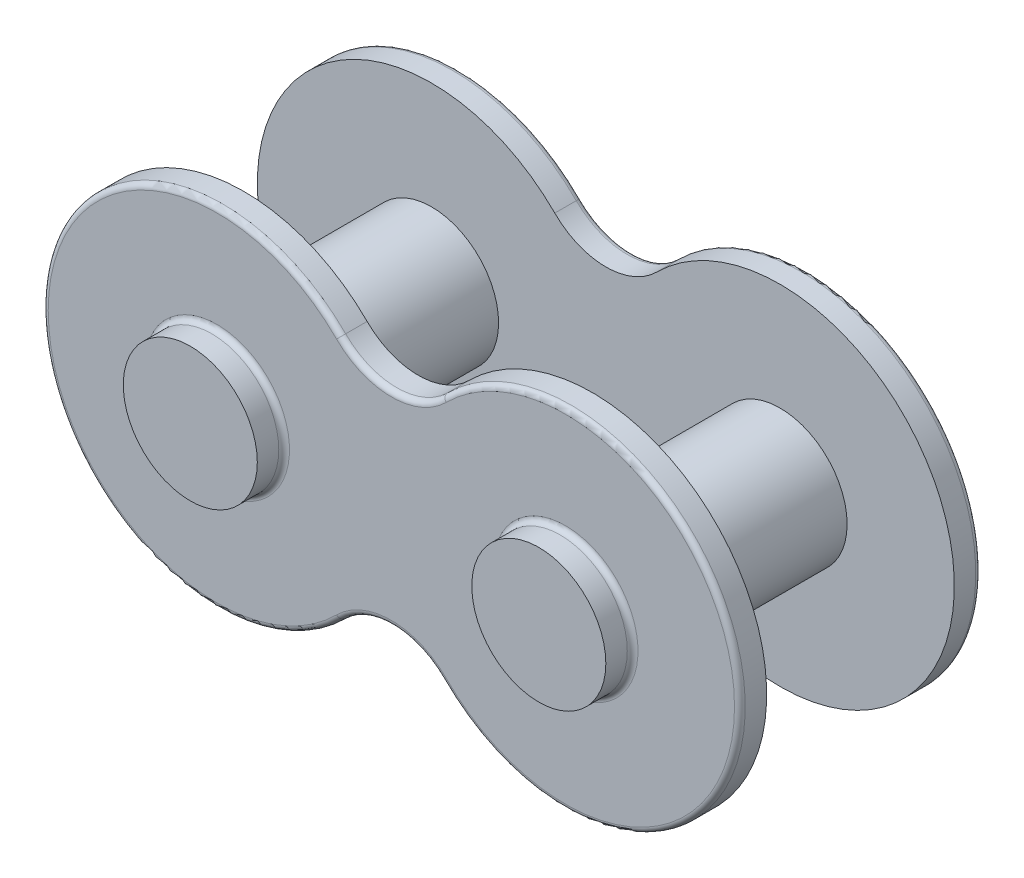
ISO-10303-21;
HEADER;
FILE_DESCRIPTION(('STEP AP214'),'2;1');
FILE_NAME('part.step','',(''),(''),'','','');
FILE_SCHEMA(('AUTOMOTIVE_DESIGN { 1 0 10303 214 1 1 1 1 }'));
ENDSEC;
DATA;
#1=APPLICATION_CONTEXT('core data for automotive mechanical design processes');
#2=APPLICATION_PROTOCOL_DEFINITION('international standard','automotive_design',2000,#1);
#3=PRODUCT_CONTEXT('',#1,'mechanical');
#4=PRODUCT('Part','Part','',(#3));
#5=PRODUCT_RELATED_PRODUCT_CATEGORY('part','',(#4));
#6=PRODUCT_DEFINITION_FORMATION('','',#4);
#7=PRODUCT_DEFINITION_CONTEXT('part definition',#1,'design');
#8=PRODUCT_DEFINITION('design','',#6,#7);
#9=PRODUCT_DEFINITION_SHAPE('','',#8);
#10=(LENGTH_UNIT() NAMED_UNIT(*) SI_UNIT(.MILLI.,.METRE.));
#11=(NAMED_UNIT(*) PLANE_ANGLE_UNIT() SI_UNIT($,.RADIAN.));
#12=(NAMED_UNIT(*) SI_UNIT($,.STERADIAN.) SOLID_ANGLE_UNIT());
#13=UNCERTAINTY_MEASURE_WITH_UNIT(LENGTH_MEASURE(1.E-05),#10,'distance_accuracy_value','');
#14=(GEOMETRIC_REPRESENTATION_CONTEXT(3) GLOBAL_UNCERTAINTY_ASSIGNED_CONTEXT((#13)) GLOBAL_UNIT_ASSIGNED_CONTEXT((#10,
#11,#12)) REPRESENTATION_CONTEXT('',''));
#15=CARTESIAN_POINT('',(0.,0.,0.));
#16=DIRECTION('',(0.,0.,1.));
#17=DIRECTION('',(1.,0.,0.));
#18=AXIS2_PLACEMENT_3D('',#15,#16,#17);
#19=CARTESIAN_POINT('',(-3.25,-3.25,1.));
#20=DIRECTION('',(0.,0.,1.));
#21=DIRECTION('',(1.,0.,0.));
#22=AXIS2_PLACEMENT_3D('',#19,#20,#21);
#23=PLANE('',#22);
#24=CARTESIAN_POINT('',(-6.5,0.,1.));
#25=DIRECTION('',(0.,0.,1.));
#26=DIRECTION('',(1.,0.,0.));
#27=AXIS2_PLACEMENT_3D('',#24,#25,#26);
#28=CIRCLE('',#27,2.5);
#29=CARTESIAN_POINT('',(-4.,0.,1.));
#30=VERTEX_POINT('',#29);
#31=EDGE_CURVE('E174',#30,#30,#28,.T.);
#32=ORIENTED_EDGE('',*,*,#31,.F.);
#33=EDGE_LOOP('',(#32));
#34=FACE_BOUND('',#33,.T.);
#35=CARTESIAN_POINT('',(0.,-6.5,1.));
#36=DIRECTION('',(0.,0.,-1.));
#37=DIRECTION('',(1.,0.,0.));
#38=AXIS2_PLACEMENT_3D('',#35,#36,#37);
#39=CIRCLE('',#38,2.69238815542512);
#40=CARTESIAN_POINT('',(-1.90380592228744,-4.59619407771256,1.));
#41=VERTEX_POINT('',#40);
#42=CARTESIAN_POINT('',(1.90380592228744,-4.59619407771256,1.));
#43=VERTEX_POINT('',#42);
#44=EDGE_CURVE('E177',#41,#43,#39,.T.);
#45=ORIENTED_EDGE('',*,*,#44,.T.);
#46=CARTESIAN_POINT('',(6.5,0.,1.));
#47=DIRECTION('',(0.,0.,1.));
#48=DIRECTION('',(1.,0.,0.));
#49=AXIS2_PLACEMENT_3D('',#46,#47,#48);
#50=CIRCLE('',#49,6.5);
#51=CARTESIAN_POINT('',(1.90380592228744,4.59619407771256,1.));
#52=VERTEX_POINT('',#51);
#53=EDGE_CURVE('E180',#43,#52,#50,.T.);
#54=ORIENTED_EDGE('',*,*,#53,.T.);
#55=CARTESIAN_POINT('',(0.,6.5,1.));
#56=DIRECTION('',(0.,0.,-1.));
#57=DIRECTION('',(1.,0.,0.));
#58=AXIS2_PLACEMENT_3D('',#55,#56,#57);
#59=CIRCLE('',#58,2.69238815542512);
#60=CARTESIAN_POINT('',(-1.90380592228744,4.59619407771256,1.));
#61=VERTEX_POINT('',#60);
#62=EDGE_CURVE('E182',#52,#61,#59,.T.);
#63=ORIENTED_EDGE('',*,*,#62,.T.);
#64=CARTESIAN_POINT('',(-6.5,0.,1.));
#65=DIRECTION('',(0.,0.,1.));
#66=DIRECTION('',(1.,0.,0.));
#67=AXIS2_PLACEMENT_3D('',#64,#65,#66);
#68=CIRCLE('',#67,6.5);
#69=EDGE_CURVE('E184',#61,#41,#68,.T.);
#70=ORIENTED_EDGE('',*,*,#69,.T.);
#71=EDGE_LOOP('',(#45,#54,#63,#70));
#72=FACE_BOUND('',#71,.T.);
#73=CARTESIAN_POINT('',(6.5,0.,1.));
#74=DIRECTION('',(0.,0.,1.));
#75=DIRECTION('',(1.,0.,0.));
#76=AXIS2_PLACEMENT_3D('',#73,#74,#75);
#77=CIRCLE('',#76,2.5);
#78=CARTESIAN_POINT('',(9.,0.,1.));
#79=VERTEX_POINT('',#78);
#80=EDGE_CURVE('E171',#79,#79,#77,.T.);
#81=ORIENTED_EDGE('',*,*,#80,.F.);
#82=EDGE_LOOP('',(#81));
#83=FACE_BOUND('',#82,.T.);
#84=ADVANCED_FACE('F33',(#34,#72,#83),#23,.T.);
#85=CARTESIAN_POINT('',(-3.25,-3.25,0.));
#86=DIRECTION('',(0.,0.,1.));
#87=DIRECTION('',(1.,0.,0.));
#88=AXIS2_PLACEMENT_3D('',#85,#86,#87);
#89=PLANE('',#88);
#90=CARTESIAN_POINT('',(6.5,0.,0.));
#91=DIRECTION('',(0.,0.,1.));
#92=DIRECTION('',(1.,0.,0.));
#93=AXIS2_PLACEMENT_3D('',#90,#91,#92);
#94=CIRCLE('',#93,2.7);
#95=CARTESIAN_POINT('',(9.2,0.,0.));
#96=VERTEX_POINT('',#95);
#97=EDGE_CURVE('E216',#96,#96,#94,.T.);
#98=ORIENTED_EDGE('',*,*,#97,.T.);
#99=EDGE_LOOP('',(#98));
#100=FACE_BOUND('',#99,.T.);
#101=CARTESIAN_POINT('',(-6.5,0.,0.));
#102=DIRECTION('',(0.,0.,1.));
#103=DIRECTION('',(1.,0.,0.));
#104=AXIS2_PLACEMENT_3D('',#101,#102,#103);
#105=CIRCLE('',#104,2.7);
#106=CARTESIAN_POINT('',(-3.8,0.,0.));
#107=VERTEX_POINT('',#106);
#108=EDGE_CURVE('E213',#107,#107,#105,.T.);
#109=ORIENTED_EDGE('',*,*,#108,.T.);
#110=EDGE_LOOP('',(#109));
#111=FACE_BOUND('',#110,.T.);
#112=CARTESIAN_POINT('',(0.,6.5,0.));
#113=DIRECTION('',(0.,0.,1.));
#114=DIRECTION('',(1.,0.,0.));
#115=AXIS2_PLACEMENT_3D('',#112,#113,#114);
#116=CIRCLE('',#115,2.89238815542512);
#117=CARTESIAN_POINT('',(-2.04522727852475,4.45477272147525,0.));
#118=VERTEX_POINT('',#117);
#119=CARTESIAN_POINT('',(2.04522727852475,4.45477272147525,0.));
#120=VERTEX_POINT('',#119);
#121=EDGE_CURVE('E208',#118,#120,#116,.T.);
#122=ORIENTED_EDGE('',*,*,#121,.T.);
#123=CARTESIAN_POINT('',(6.5,0.,0.));
#124=DIRECTION('',(0.,0.,1.));
#125=DIRECTION('',(1.,0.,0.));
#126=AXIS2_PLACEMENT_3D('',#123,#124,#125);
#127=CIRCLE('',#126,6.3);
#128=CARTESIAN_POINT('',(2.04522727852475,-4.45477272147525,0.));
#129=VERTEX_POINT('',#128);
#130=EDGE_CURVE('E210',#120,#129,#127,.F.);
#131=ORIENTED_EDGE('',*,*,#130,.T.);
#132=CARTESIAN_POINT('',(0.,-6.5,0.));
#133=DIRECTION('',(0.,0.,1.));
#134=DIRECTION('',(1.,0.,0.));
#135=AXIS2_PLACEMENT_3D('',#132,#133,#134);
#136=CIRCLE('',#135,2.89238815542512);
#137=CARTESIAN_POINT('',(-2.04522727852475,-4.45477272147525,0.));
#138=VERTEX_POINT('',#137);
#139=EDGE_CURVE('E204',#129,#138,#136,.T.);
#140=ORIENTED_EDGE('',*,*,#139,.T.);
#141=CARTESIAN_POINT('',(-6.5,0.,0.));
#142=DIRECTION('',(0.,0.,1.));
#143=DIRECTION('',(1.,0.,0.));
#144=AXIS2_PLACEMENT_3D('',#141,#142,#143);
#145=CIRCLE('',#144,6.3);
#146=EDGE_CURVE('E206',#138,#118,#145,.F.);
#147=ORIENTED_EDGE('',*,*,#146,.T.);
#148=EDGE_LOOP('',(#122,#131,#140,#147));
#149=FACE_BOUND('',#148,.T.);
#150=ADVANCED_FACE('F301',(#100,#111,#149),#89,.F.);
#151=CARTESIAN_POINT('',(0.,-6.5,1.));
#152=DIRECTION('',(0.,0.,-1.));
#153=DIRECTION('',(-1.,0.,0.));
#154=AXIS2_PLACEMENT_3D('',#151,#152,#153);
#155=CYLINDRICAL_SURFACE('',#154,2.69238815542512);
#156=DIRECTION('',(0.,0.,-1.));
#157=VECTOR('',#156,1.);
#158=CARTESIAN_POINT('',(-1.90380592228744,-4.59619407771256,1.));
#159=LINE('',#158,#157);
#160=CARTESIAN_POINT('',(-1.90380592228744,-4.59619407771256,0.2));
#161=VERTEX_POINT('',#160);
#162=EDGE_CURVE('E186',#41,#161,#159,.T.);
#163=ORIENTED_EDGE('',*,*,#162,.T.);
#164=CARTESIAN_POINT('',(0.,-6.5,0.2));
#165=DIRECTION('',(0.,0.,1.));
#166=DIRECTION('',(1.,0.,0.));
#167=AXIS2_PLACEMENT_3D('',#164,#165,#166);
#168=CIRCLE('',#167,2.69238815542512);
#169=CARTESIAN_POINT('',(1.90380592228744,-4.59619407771256,0.2));
#170=VERTEX_POINT('',#169);
#171=EDGE_CURVE('E232',#161,#170,#168,.F.);
#172=ORIENTED_EDGE('',*,*,#171,.T.);
#173=DIRECTION('',(0.,0.,-1.));
#174=VECTOR('',#173,1.);
#175=CARTESIAN_POINT('',(1.90380592228744,-4.59619407771256,1.));
#176=LINE('',#175,#174);
#177=EDGE_CURVE('E195',#43,#170,#176,.T.);
#178=ORIENTED_EDGE('',*,*,#177,.F.);
#179=ORIENTED_EDGE('',*,*,#44,.F.);
#180=EDGE_LOOP('',(#163,#172,#178,#179));
#181=FACE_BOUND('',#180,.T.);
#182=ADVANCED_FACE('F307',(#181),#155,.F.);
#183=CARTESIAN_POINT('',(6.5,0.,1.));
#184=DIRECTION('',(0.,0.,-1.));
#185=DIRECTION('',(-1.,0.,0.));
#186=AXIS2_PLACEMENT_3D('',#183,#184,#185);
#187=CYLINDRICAL_SURFACE('',#186,6.5);
#188=ORIENTED_EDGE('',*,*,#177,.T.);
#189=CARTESIAN_POINT('',(6.5,0.,0.2));
#190=DIRECTION('',(0.,0.,1.));
#191=DIRECTION('',(1.,0.,0.));
#192=AXIS2_PLACEMENT_3D('',#189,#190,#191);
#193=CIRCLE('',#192,6.5);
#194=CARTESIAN_POINT('',(1.90380592228744,4.59619407771256,0.2));
#195=VERTEX_POINT('',#194);
#196=EDGE_CURVE('E225',#170,#195,#193,.T.);
#197=ORIENTED_EDGE('',*,*,#196,.T.);
#198=DIRECTION('',(0.,0.,-1.));
#199=VECTOR('',#198,1.);
#200=CARTESIAN_POINT('',(1.90380592228744,4.59619407771256,1.));
#201=LINE('',#200,#199);
#202=EDGE_CURVE('E192',#52,#195,#201,.T.);
#203=ORIENTED_EDGE('',*,*,#202,.F.);
#204=ORIENTED_EDGE('',*,*,#53,.F.);
#205=EDGE_LOOP('',(#188,#197,#203,#204));
#206=FACE_BOUND('',#205,.T.);
#207=ADVANCED_FACE('F324',(#206),#187,.T.);
#208=CARTESIAN_POINT('',(0.,6.5,1.));
#209=DIRECTION('',(0.,0.,-1.));
#210=DIRECTION('',(-1.,0.,0.));
#211=AXIS2_PLACEMENT_3D('',#208,#209,#210);
#212=CYLINDRICAL_SURFACE('',#211,2.69238815542512);
#213=ORIENTED_EDGE('',*,*,#202,.T.);
#214=CARTESIAN_POINT('',(0.,6.5,0.2));
#215=DIRECTION('',(0.,0.,1.));
#216=DIRECTION('',(1.,0.,0.));
#217=AXIS2_PLACEMENT_3D('',#214,#215,#216);
#218=CIRCLE('',#217,2.69238815542512);
#219=CARTESIAN_POINT('',(-1.90380592228744,4.59619407771256,0.2));
#220=VERTEX_POINT('',#219);
#221=EDGE_CURVE('E228',#195,#220,#218,.F.);
#222=ORIENTED_EDGE('',*,*,#221,.T.);
#223=DIRECTION('',(0.,0.,-1.));
#224=VECTOR('',#223,1.);
#225=CARTESIAN_POINT('',(-1.90380592228744,4.59619407771256,1.));
#226=LINE('',#225,#224);
#227=EDGE_CURVE('E189',#61,#220,#226,.T.);
#228=ORIENTED_EDGE('',*,*,#227,.F.);
#229=ORIENTED_EDGE('',*,*,#62,.F.);
#230=EDGE_LOOP('',(#213,#222,#228,#229));
#231=FACE_BOUND('',#230,.T.);
#232=ADVANCED_FACE('F320',(#231),#212,.F.);
#233=CARTESIAN_POINT('',(-6.5,0.,1.));
#234=DIRECTION('',(0.,0.,-1.));
#235=DIRECTION('',(-1.,0.,0.));
#236=AXIS2_PLACEMENT_3D('',#233,#234,#235);
#237=CYLINDRICAL_SURFACE('',#236,6.5);
#238=ORIENTED_EDGE('',*,*,#227,.T.);
#239=CARTESIAN_POINT('',(-6.5,0.,0.2));
#240=DIRECTION('',(0.,0.,1.));
#241=DIRECTION('',(1.,0.,0.));
#242=AXIS2_PLACEMENT_3D('',#239,#240,#241);
#243=CIRCLE('',#242,6.5);
#244=EDGE_CURVE('E230',#220,#161,#243,.T.);
#245=ORIENTED_EDGE('',*,*,#244,.T.);
#246=ORIENTED_EDGE('',*,*,#162,.F.);
#247=ORIENTED_EDGE('',*,*,#69,.F.);
#248=EDGE_LOOP('',(#238,#245,#246,#247));
#249=FACE_BOUND('',#248,.T.);
#250=ADVANCED_FACE('F316',(#249),#237,.T.);
#251=CARTESIAN_POINT('',(-6.5,0.,-1.));
#252=DIRECTION('',(0.,0.,1.));
#253=DIRECTION('',(1.,0.,0.));
#254=AXIS2_PLACEMENT_3D('',#251,#252,#253);
#255=PLANE('',#254);
#256=CARTESIAN_POINT('',(-6.5,0.,-1.));
#257=DIRECTION('',(0.,0.,1.));
#258=DIRECTION('',(1.,0.,0.));
#259=AXIS2_PLACEMENT_3D('',#256,#257,#258);
#260=CIRCLE('',#259,2.5);
#261=CARTESIAN_POINT('',(-4.,0.,-1.));
#262=VERTEX_POINT('',#261);
#263=EDGE_CURVE('E168',#262,#262,#260,.T.);
#264=ORIENTED_EDGE('',*,*,#263,.F.);
#265=EDGE_LOOP('',(#264));
#266=FACE_BOUND('',#265,.T.);
#267=ADVANCED_FACE('F319',(#266),#255,.F.);
#268=CARTESIAN_POINT('',(-6.5,0.,-1.));
#269=DIRECTION('',(0.,0.,1.));
#270=DIRECTION('',(1.,0.,0.));
#271=AXIS2_PLACEMENT_3D('',#268,#269,#270);
#272=CYLINDRICAL_SURFACE('',#271,2.5);
#273=CARTESIAN_POINT('',(-6.5,0.,-0.2));
#274=DIRECTION('',(0.,0.,1.));
#275=DIRECTION('',(1.,0.,0.));
#276=AXIS2_PLACEMENT_3D('',#273,#274,#275);
#277=CIRCLE('',#276,2.5);
#278=CARTESIAN_POINT('',(-4.,0.,-0.2));
#279=VERTEX_POINT('',#278);
#280=EDGE_CURVE('E222',#279,#279,#277,.F.);
#281=ORIENTED_EDGE('',*,*,#280,.T.);
#282=EDGE_LOOP('',(#281));
#283=FACE_BOUND('',#282,.T.);
#284=ORIENTED_EDGE('',*,*,#263,.T.);
#285=EDGE_LOOP('',(#284));
#286=FACE_BOUND('',#285,.T.);
#287=ADVANCED_FACE('F380',(#283,#286),#272,.T.);
#288=CARTESIAN_POINT('',(-6.5,0.,8.));
#289=DIRECTION('',(0.,0.,-1.));
#290=DIRECTION('',(-1.,0.,0.));
#291=AXIS2_PLACEMENT_3D('',#288,#289,#290);
#292=CIRCLE('',#291,2.5);
#293=CARTESIAN_POINT('',(-9.,0.,8.));
#294=VERTEX_POINT('',#293);
#295=EDGE_CURVE('E201',#294,#294,#292,.F.);
#296=ORIENTED_EDGE('',*,*,#295,.F.);
#297=EDGE_LOOP('',(#296));
#298=FACE_BOUND('',#297,.T.);
#299=ORIENTED_EDGE('',*,*,#31,.T.);
#300=EDGE_LOOP('',(#299));
#301=FACE_BOUND('',#300,.T.);
#302=ADVANCED_FACE('F313',(#298,#301),#272,.T.);
#303=CARTESIAN_POINT('',(6.5,0.,-1.));
#304=DIRECTION('',(0.,0.,1.));
#305=DIRECTION('',(1.,0.,0.));
#306=AXIS2_PLACEMENT_3D('',#303,#304,#305);
#307=PLANE('',#306);
#308=CARTESIAN_POINT('',(6.5,0.,-1.));
#309=DIRECTION('',(0.,0.,1.));
#310=DIRECTION('',(1.,0.,0.));
#311=AXIS2_PLACEMENT_3D('',#308,#309,#310);
#312=CIRCLE('',#311,2.5);
#313=CARTESIAN_POINT('',(9.,0.,-1.));
#314=VERTEX_POINT('',#313);
#315=EDGE_CURVE('E162',#314,#314,#312,.T.);
#316=ORIENTED_EDGE('',*,*,#315,.F.);
#317=EDGE_LOOP('',(#316));
#318=FACE_BOUND('',#317,.T.);
#319=ADVANCED_FACE('F403',(#318),#307,.F.);
#320=CARTESIAN_POINT('',(6.5,0.,-1.));
#321=DIRECTION('',(0.,0.,1.));
#322=DIRECTION('',(1.,0.,0.));
#323=AXIS2_PLACEMENT_3D('',#320,#321,#322);
#324=CYLINDRICAL_SURFACE('',#323,2.5);
#325=CARTESIAN_POINT('',(6.5,0.,-0.2));
#326=DIRECTION('',(0.,0.,1.));
#327=DIRECTION('',(1.,0.,0.));
#328=AXIS2_PLACEMENT_3D('',#325,#326,#327);
#329=CIRCLE('',#328,2.5);
#330=CARTESIAN_POINT('',(9.,0.,-0.2));
#331=VERTEX_POINT('',#330);
#332=EDGE_CURVE('E219',#331,#331,#329,.F.);
#333=ORIENTED_EDGE('',*,*,#332,.T.);
#334=EDGE_LOOP('',(#333));
#335=FACE_BOUND('',#334,.T.);
#336=ORIENTED_EDGE('',*,*,#315,.T.);
#337=EDGE_LOOP('',(#336));
#338=FACE_BOUND('',#337,.T.);
#339=ADVANCED_FACE('F433',(#335,#338),#324,.T.);
#340=CARTESIAN_POINT('',(6.5,0.,8.));
#341=DIRECTION('',(0.,0.,-1.));
#342=DIRECTION('',(-1.,0.,0.));
#343=AXIS2_PLACEMENT_3D('',#340,#341,#342);
#344=CIRCLE('',#343,2.5);
#345=CARTESIAN_POINT('',(4.,0.,8.));
#346=VERTEX_POINT('',#345);
#347=EDGE_CURVE('E198',#346,#346,#344,.F.);
#348=ORIENTED_EDGE('',*,*,#347,.F.);
#349=EDGE_LOOP('',(#348));
#350=FACE_BOUND('',#349,.T.);
#351=ORIENTED_EDGE('',*,*,#80,.T.);
#352=EDGE_LOOP('',(#351));
#353=FACE_BOUND('',#352,.T.);
#354=ADVANCED_FACE('F390',(#350,#353),#324,.T.);
#355=CARTESIAN_POINT('',(0.,-6.5,8.));
#356=DIRECTION('',(0.,0.,1.));
#357=DIRECTION('',(1.,0.,0.));
#358=AXIS2_PLACEMENT_3D('',#355,#356,#357);
#359=CYLINDRICAL_SURFACE('',#358,2.69238815542512);
#360=DIRECTION('',(0.,0.,1.));
#361=VECTOR('',#360,1.);
#362=CARTESIAN_POINT('',(1.90380592228744,-4.59619407771256,8.));
#363=LINE('',#362,#361);
#364=CARTESIAN_POINT('',(1.90380592228744,-4.59619407771256,8.));
#365=VERTEX_POINT('',#364);
#366=CARTESIAN_POINT('',(1.90380592228744,-4.59619407771256,8.8));
#367=VERTEX_POINT('',#366);
#368=EDGE_CURVE('E155',#365,#367,#363,.T.);
#369=ORIENTED_EDGE('',*,*,#368,.T.);
#370=CARTESIAN_POINT('',(0.,-6.5,8.8));
#371=DIRECTION('',(0.,0.,-1.));
#372=DIRECTION('',(-1.,0.,0.));
#373=AXIS2_PLACEMENT_3D('',#370,#371,#372);
#374=CIRCLE('',#373,2.69238815542512);
#375=CARTESIAN_POINT('',(-1.90380592228744,-4.59619407771256,8.8));
#376=VERTEX_POINT('',#375);
#377=EDGE_CURVE('E131',#367,#376,#374,.F.);
#378=ORIENTED_EDGE('',*,*,#377,.T.);
#379=DIRECTION('',(0.,0.,1.));
#380=VECTOR('',#379,1.);
#381=CARTESIAN_POINT('',(-1.90380592228744,-4.59619407771256,8.));
#382=LINE('',#381,#380);
#383=CARTESIAN_POINT('',(-1.90380592228744,-4.59619407771256,8.));
#384=VERTEX_POINT('',#383);
#385=EDGE_CURVE('E125',#384,#376,#382,.T.);
#386=ORIENTED_EDGE('',*,*,#385,.F.);
#387=CARTESIAN_POINT('',(0.,-6.5,8.));
#388=DIRECTION('',(0.,0.,-1.));
#389=DIRECTION('',(1.,0.,0.));
#390=AXIS2_PLACEMENT_3D('',#387,#388,#389);
#391=CIRCLE('',#390,2.69238815542512);
#392=EDGE_CURVE('E128',#384,#365,#391,.T.);
#393=ORIENTED_EDGE('',*,*,#392,.T.);
#394=EDGE_LOOP('',(#369,#378,#386,#393));
#395=FACE_BOUND('',#394,.T.);
#396=ADVANCED_FACE('F127',(#395),#359,.F.);
#397=CARTESIAN_POINT('',(-6.5,0.,8.));
#398=DIRECTION('',(0.,0.,1.));
#399=DIRECTION('',(1.,0.,0.));
#400=AXIS2_PLACEMENT_3D('',#397,#398,#399);
#401=CYLINDRICAL_SURFACE('',#400,6.5);
#402=ORIENTED_EDGE('',*,*,#385,.T.);
#403=CARTESIAN_POINT('',(-6.5,0.,8.8));
#404=DIRECTION('',(0.,0.,-1.));
#405=DIRECTION('',(-1.,0.,0.));
#406=AXIS2_PLACEMENT_3D('',#403,#404,#405);
#407=CIRCLE('',#406,6.5);
#408=CARTESIAN_POINT('',(-1.90380592228744,4.59619407771256,8.8));
#409=VERTEX_POINT('',#408);
#410=EDGE_CURVE('E249',#376,#409,#407,.T.);
#411=ORIENTED_EDGE('',*,*,#410,.T.);
#412=DIRECTION('',(0.,0.,1.));
#413=VECTOR('',#412,1.);
#414=CARTESIAN_POINT('',(-1.90380592228744,4.59619407771256,8.));
#415=LINE('',#414,#413);
#416=CARTESIAN_POINT('',(-1.90380592228744,4.59619407771256,8.));
#417=VERTEX_POINT('',#416);
#418=EDGE_CURVE('E137',#417,#409,#415,.T.);
#419=ORIENTED_EDGE('',*,*,#418,.F.);
#420=CARTESIAN_POINT('',(-6.5,0.,8.));
#421=DIRECTION('',(0.,0.,1.));
#422=DIRECTION('',(1.,0.,0.));
#423=AXIS2_PLACEMENT_3D('',#420,#421,#422);
#424=CIRCLE('',#423,6.5);
#425=EDGE_CURVE('E143',#417,#384,#424,.T.);
#426=ORIENTED_EDGE('',*,*,#425,.T.);
#427=EDGE_LOOP('',(#402,#411,#419,#426));
#428=FACE_BOUND('',#427,.T.);
#429=ADVANCED_FACE('F149',(#428),#401,.T.);
#430=CARTESIAN_POINT('',(0.,6.5,8.));
#431=DIRECTION('',(0.,0.,1.));
#432=DIRECTION('',(1.,0.,0.));
#433=AXIS2_PLACEMENT_3D('',#430,#431,#432);
#434=CYLINDRICAL_SURFACE('',#433,2.69238815542512);
#435=ORIENTED_EDGE('',*,*,#418,.T.);
#436=CARTESIAN_POINT('',(0.,6.5,8.8));
#437=DIRECTION('',(0.,0.,-1.));
#438=DIRECTION('',(-1.,0.,0.));
#439=AXIS2_PLACEMENT_3D('',#436,#437,#438);
#440=CIRCLE('',#439,2.69238815542512);
#441=CARTESIAN_POINT('',(1.90380592228744,4.59619407771256,8.8));
#442=VERTEX_POINT('',#441);
#443=EDGE_CURVE('E58',#409,#442,#440,.F.);
#444=ORIENTED_EDGE('',*,*,#443,.T.);
#445=DIRECTION('',(0.,0.,1.));
#446=VECTOR('',#445,1.);
#447=CARTESIAN_POINT('',(1.90380592228744,4.59619407771256,8.));
#448=LINE('',#447,#446);
#449=CARTESIAN_POINT('',(1.90380592228744,4.59619407771256,8.));
#450=VERTEX_POINT('',#449);
#451=EDGE_CURVE('E157',#450,#442,#448,.T.);
#452=ORIENTED_EDGE('',*,*,#451,.F.);
#453=CARTESIAN_POINT('',(0.,6.5,8.));
#454=DIRECTION('',(0.,0.,-1.));
#455=DIRECTION('',(1.,0.,0.));
#456=AXIS2_PLACEMENT_3D('',#453,#454,#455);
#457=CIRCLE('',#456,2.69238815542512);
#458=EDGE_CURVE('E150',#450,#417,#457,.T.);
#459=ORIENTED_EDGE('',*,*,#458,.T.);
#460=EDGE_LOOP('',(#435,#444,#452,#459));
#461=FACE_BOUND('',#460,.T.);
#462=ADVANCED_FACE('F287',(#461),#434,.F.);
#463=CARTESIAN_POINT('',(6.5,0.,8.));
#464=DIRECTION('',(0.,0.,1.));
#465=DIRECTION('',(1.,0.,0.));
#466=AXIS2_PLACEMENT_3D('',#463,#464,#465);
#467=CYLINDRICAL_SURFACE('',#466,6.5);
#468=ORIENTED_EDGE('',*,*,#451,.T.);
#469=CARTESIAN_POINT('',(6.5,0.,8.8));
#470=DIRECTION('',(0.,0.,-1.));
#471=DIRECTION('',(-1.,0.,0.));
#472=AXIS2_PLACEMENT_3D('',#469,#470,#471);
#473=CIRCLE('',#472,6.5);
#474=EDGE_CURVE('E50',#442,#367,#473,.T.);
#475=ORIENTED_EDGE('',*,*,#474,.T.);
#476=ORIENTED_EDGE('',*,*,#368,.F.);
#477=CARTESIAN_POINT('',(6.5,0.,8.));
#478=DIRECTION('',(0.,0.,1.));
#479=DIRECTION('',(1.,0.,0.));
#480=AXIS2_PLACEMENT_3D('',#477,#478,#479);
#481=CIRCLE('',#480,6.5);
#482=EDGE_CURVE('E146',#365,#450,#481,.T.);
#483=ORIENTED_EDGE('',*,*,#482,.T.);
#484=EDGE_LOOP('',(#468,#475,#476,#483));
#485=FACE_BOUND('',#484,.T.);
#486=ADVANCED_FACE('F288',(#485),#467,.T.);
#487=CARTESIAN_POINT('',(-3.25,-3.25,8.));
#488=DIRECTION('',(0.,0.,-1.));
#489=DIRECTION('',(1.,0.,0.));
#490=AXIS2_PLACEMENT_3D('',#487,#488,#489);
#491=PLANE('',#490);
#492=ORIENTED_EDGE('',*,*,#347,.T.);
#493=EDGE_LOOP('',(#492));
#494=FACE_BOUND('',#493,.T.);
#495=ORIENTED_EDGE('',*,*,#295,.T.);
#496=EDGE_LOOP('',(#495));
#497=FACE_BOUND('',#496,.T.);
#498=ORIENTED_EDGE('',*,*,#392,.F.);
#499=ORIENTED_EDGE('',*,*,#425,.F.);
#500=ORIENTED_EDGE('',*,*,#458,.F.);
#501=ORIENTED_EDGE('',*,*,#482,.F.);
#502=EDGE_LOOP('',(#498,#499,#500,#501));
#503=FACE_BOUND('',#502,.T.);
#504=ADVANCED_FACE('F141',(#494,#497,#503),#491,.T.);
#505=CARTESIAN_POINT('',(-3.25,-3.25,9.));
#506=DIRECTION('',(0.,0.,-1.));
#507=DIRECTION('',(1.,0.,0.));
#508=AXIS2_PLACEMENT_3D('',#505,#506,#507);
#509=PLANE('',#508);
#510=CARTESIAN_POINT('',(0.,6.5,9.));
#511=DIRECTION('',(0.,0.,-1.));
#512=DIRECTION('',(-1.,0.,0.));
#513=AXIS2_PLACEMENT_3D('',#510,#511,#512);
#514=CIRCLE('',#513,2.89238815542512);
#515=CARTESIAN_POINT('',(2.04522727852475,4.45477272147525,9.));
#516=VERTEX_POINT('',#515);
#517=CARTESIAN_POINT('',(-2.04522727852475,4.45477272147525,9.));
#518=VERTEX_POINT('',#517);
#519=EDGE_CURVE('E244',#516,#518,#514,.T.);
#520=ORIENTED_EDGE('',*,*,#519,.T.);
#521=CARTESIAN_POINT('',(-6.5,0.,9.));
#522=DIRECTION('',(0.,0.,-1.));
#523=DIRECTION('',(-1.,0.,0.));
#524=AXIS2_PLACEMENT_3D('',#521,#522,#523);
#525=CIRCLE('',#524,6.3);
#526=CARTESIAN_POINT('',(-2.04522727852475,-4.45477272147525,9.));
#527=VERTEX_POINT('',#526);
#528=EDGE_CURVE('E246',#518,#527,#525,.F.);
#529=ORIENTED_EDGE('',*,*,#528,.T.);
#530=CARTESIAN_POINT('',(0.,-6.5,9.));
#531=DIRECTION('',(0.,0.,-1.));
#532=DIRECTION('',(-1.,0.,0.));
#533=AXIS2_PLACEMENT_3D('',#530,#531,#532);
#534=CIRCLE('',#533,2.89238815542512);
#535=CARTESIAN_POINT('',(2.04522727852475,-4.45477272147525,9.));
#536=VERTEX_POINT('',#535);
#537=EDGE_CURVE('E240',#527,#536,#534,.T.);
#538=ORIENTED_EDGE('',*,*,#537,.T.);
#539=CARTESIAN_POINT('',(6.5,0.,9.));
#540=DIRECTION('',(0.,0.,-1.));
#541=DIRECTION('',(-1.,0.,0.));
#542=AXIS2_PLACEMENT_3D('',#539,#540,#541);
#543=CIRCLE('',#542,6.3);
#544=EDGE_CURVE('E242',#536,#516,#543,.F.);
#545=ORIENTED_EDGE('',*,*,#544,.T.);
#546=EDGE_LOOP('',(#520,#529,#538,#545));
#547=FACE_BOUND('',#546,.T.);
#548=CARTESIAN_POINT('',(-6.5,0.,9.));
#549=DIRECTION('',(0.,0.,-1.));
#550=DIRECTION('',(-1.,0.,0.));
#551=AXIS2_PLACEMENT_3D('',#548,#549,#550);
#552=CIRCLE('',#551,2.7);
#553=CARTESIAN_POINT('',(-9.2,0.,9.));
#554=VERTEX_POINT('',#553);
#555=EDGE_CURVE('E237',#554,#554,#552,.T.);
#556=ORIENTED_EDGE('',*,*,#555,.T.);
#557=EDGE_LOOP('',(#556));
#558=FACE_BOUND('',#557,.T.);
#559=CARTESIAN_POINT('',(6.5,0.,9.));
#560=DIRECTION('',(0.,0.,-1.));
#561=DIRECTION('',(-1.,0.,0.));
#562=AXIS2_PLACEMENT_3D('',#559,#560,#561);
#563=CIRCLE('',#562,2.7);
#564=CARTESIAN_POINT('',(3.8,0.,9.));
#565=VERTEX_POINT('',#564);
#566=EDGE_CURVE('E234',#565,#565,#563,.T.);
#567=ORIENTED_EDGE('',*,*,#566,.T.);
#568=EDGE_LOOP('',(#567));
#569=FACE_BOUND('',#568,.T.);
#570=ADVANCED_FACE('F295',(#547,#558,#569),#509,.F.);
#571=CARTESIAN_POINT('',(-6.5,0.,10.));
#572=DIRECTION('',(0.,0.,1.));
#573=DIRECTION('',(1.,0.,0.));
#574=AXIS2_PLACEMENT_3D('',#571,#572,#573);
#575=PLANE('',#574);
#576=CARTESIAN_POINT('',(-6.5,0.,10.));
#577=DIRECTION('',(0.,0.,1.));
#578=DIRECTION('',(1.,0.,0.));
#579=AXIS2_PLACEMENT_3D('',#576,#577,#578);
#580=CIRCLE('',#579,2.5);
#581=CARTESIAN_POINT('',(-4.,0.,10.));
#582=VERTEX_POINT('',#581);
#583=EDGE_CURVE('E165',#582,#582,#580,.T.);
#584=ORIENTED_EDGE('',*,*,#583,.T.);
#585=EDGE_LOOP('',(#584));
#586=FACE_BOUND('',#585,.T.);
#587=ADVANCED_FACE('F379',(#586),#575,.T.);
#588=CARTESIAN_POINT('',(-6.5,0.,9.2));
#589=DIRECTION('',(0.,0.,-1.));
#590=DIRECTION('',(-1.,0.,0.));
#591=AXIS2_PLACEMENT_3D('',#588,#589,#590);
#592=CIRCLE('',#591,2.5);
#593=CARTESIAN_POINT('',(-9.,0.,9.2));
#594=VERTEX_POINT('',#593);
#595=EDGE_CURVE('E42',#594,#594,#592,.F.);
#596=ORIENTED_EDGE('',*,*,#595,.T.);
#597=EDGE_LOOP('',(#596));
#598=FACE_BOUND('',#597,.T.);
#599=ORIENTED_EDGE('',*,*,#583,.F.);
#600=EDGE_LOOP('',(#599));
#601=FACE_BOUND('',#600,.T.);
#602=ADVANCED_FACE('F375',(#598,#601),#272,.T.);
#603=CARTESIAN_POINT('',(6.5,0.,10.));
#604=DIRECTION('',(0.,0.,1.));
#605=DIRECTION('',(1.,0.,0.));
#606=AXIS2_PLACEMENT_3D('',#603,#604,#605);
#607=PLANE('',#606);
#608=CARTESIAN_POINT('',(6.5,0.,10.));
#609=DIRECTION('',(0.,0.,1.));
#610=DIRECTION('',(1.,0.,0.));
#611=AXIS2_PLACEMENT_3D('',#608,#609,#610);
#612=CIRCLE('',#611,2.5);
#613=CARTESIAN_POINT('',(9.,0.,10.));
#614=VERTEX_POINT('',#613);
#615=EDGE_CURVE('E136',#614,#614,#612,.T.);
#616=ORIENTED_EDGE('',*,*,#615,.T.);
#617=EDGE_LOOP('',(#616));
#618=FACE_BOUND('',#617,.T.);
#619=ADVANCED_FACE('F378',(#618),#607,.T.);
#620=CARTESIAN_POINT('',(6.5,0.,9.2));
#621=DIRECTION('',(0.,0.,-1.));
#622=DIRECTION('',(-1.,0.,0.));
#623=AXIS2_PLACEMENT_3D('',#620,#621,#622);
#624=CIRCLE('',#623,2.5);
#625=CARTESIAN_POINT('',(4.,0.,9.2));
#626=VERTEX_POINT('',#625);
#627=EDGE_CURVE('E11',#626,#626,#624,.F.);
#628=ORIENTED_EDGE('',*,*,#627,.T.);
#629=EDGE_LOOP('',(#628));
#630=FACE_BOUND('',#629,.T.);
#631=ORIENTED_EDGE('',*,*,#615,.F.);
#632=EDGE_LOOP('',(#631));
#633=FACE_BOUND('',#632,.T.);
#634=ADVANCED_FACE('F336',(#630,#633),#324,.T.);
#635=CARTESIAN_POINT('',(6.5,0.,-0.2));
#636=DIRECTION('',(0.,0.,1.));
#637=DIRECTION('',(1.,0.,0.));
#638=AXIS2_PLACEMENT_3D('',#635,#636,#637);
#639=TOROIDAL_SURFACE('',#638,2.7,0.2);
#640=ORIENTED_EDGE('',*,*,#332,.F.);
#641=EDGE_LOOP('',(#640));
#642=FACE_BOUND('',#641,.T.);
#643=ORIENTED_EDGE('',*,*,#97,.F.);
#644=EDGE_LOOP('',(#643));
#645=FACE_BOUND('',#644,.T.);
#646=ADVANCED_FACE('F332',(#642,#645),#639,.F.);
#647=CARTESIAN_POINT('',(-6.5,0.,-0.2));
#648=DIRECTION('',(0.,0.,1.));
#649=DIRECTION('',(1.,0.,0.));
#650=AXIS2_PLACEMENT_3D('',#647,#648,#649);
#651=TOROIDAL_SURFACE('',#650,2.7,0.2);
#652=ORIENTED_EDGE('',*,*,#280,.F.);
#653=EDGE_LOOP('',(#652));
#654=FACE_BOUND('',#653,.T.);
#655=ORIENTED_EDGE('',*,*,#108,.F.);
#656=EDGE_LOOP('',(#655));
#657=FACE_BOUND('',#656,.T.);
#658=ADVANCED_FACE('F335',(#654,#657),#651,.F.);
#659=CARTESIAN_POINT('',(-6.5,0.,0.2));
#660=DIRECTION('',(0.,0.,1.));
#661=DIRECTION('',(1.,0.,0.));
#662=AXIS2_PLACEMENT_3D('',#659,#660,#661);
#663=TOROIDAL_SURFACE('',#662,6.3,0.2);
#664=CARTESIAN_POINT('',(-2.04522727852475,4.45477272147525,0.2));
#665=DIRECTION('',(0.707106781186547,-0.707106781186549,0.));
#666=DIRECTION('',(0.707106781186549,0.707106781186546,0.));
#667=AXIS2_PLACEMENT_3D('',#664,#665,#666);
#668=CIRCLE('',#667,0.2);
#669=EDGE_CURVE('E260',#118,#220,#668,.T.);
#670=ORIENTED_EDGE('',*,*,#669,.F.);
#671=ORIENTED_EDGE('',*,*,#146,.F.);
#672=CARTESIAN_POINT('',(-2.04522727852475,-4.45477272147525,0.2));
#673=DIRECTION('',(0.707106781186547,0.707106781186547,0.));
#674=DIRECTION('',(-0.707106781186548,0.707106781186548,0.));
#675=AXIS2_PLACEMENT_3D('',#672,#673,#674);
#676=CIRCLE('',#675,0.2);
#677=EDGE_CURVE('E147',#161,#138,#676,.T.);
#678=ORIENTED_EDGE('',*,*,#677,.F.);
#679=ORIENTED_EDGE('',*,*,#244,.F.);
#680=EDGE_LOOP('',(#670,#671,#678,#679));
#681=FACE_BOUND('',#680,.T.);
#682=ADVANCED_FACE('F340',(#681),#663,.T.);
#683=CARTESIAN_POINT('',(0.,-6.5,0.2));
#684=DIRECTION('',(0.,0.,1.));
#685=DIRECTION('',(1.,0.,0.));
#686=AXIS2_PLACEMENT_3D('',#683,#684,#685);
#687=TOROIDAL_SURFACE('',#686,2.89238815542512,0.2);
#688=ORIENTED_EDGE('',*,*,#677,.T.);
#689=ORIENTED_EDGE('',*,*,#139,.F.);
#690=CARTESIAN_POINT('',(2.04522727852475,-4.45477272147525,0.2));
#691=DIRECTION('',(0.707106781186549,-0.707106781186546,0.));
#692=DIRECTION('',(0.707106781186546,0.707106781186549,0.));
#693=AXIS2_PLACEMENT_3D('',#690,#691,#692);
#694=CIRCLE('',#693,0.2);
#695=EDGE_CURVE('E258',#170,#129,#694,.T.);
#696=ORIENTED_EDGE('',*,*,#695,.F.);
#697=ORIENTED_EDGE('',*,*,#171,.F.);
#698=EDGE_LOOP('',(#688,#689,#696,#697));
#699=FACE_BOUND('',#698,.T.);
#700=ADVANCED_FACE('F349',(#699),#687,.T.);
#701=CARTESIAN_POINT('',(0.,6.5,0.2));
#702=DIRECTION('',(0.,0.,1.));
#703=DIRECTION('',(1.,0.,0.));
#704=AXIS2_PLACEMENT_3D('',#701,#702,#703);
#705=TOROIDAL_SURFACE('',#704,2.89238815542512,0.2);
#706=ORIENTED_EDGE('',*,*,#669,.T.);
#707=ORIENTED_EDGE('',*,*,#221,.F.);
#708=CARTESIAN_POINT('',(2.04522727852475,4.45477272147525,0.2));
#709=DIRECTION('',(0.707106781186548,0.707106781186547,0.));
#710=DIRECTION('',(-0.707106781186547,0.707106781186548,0.));
#711=AXIS2_PLACEMENT_3D('',#708,#709,#710);
#712=CIRCLE('',#711,0.2);
#713=EDGE_CURVE('E256',#120,#195,#712,.T.);
#714=ORIENTED_EDGE('',*,*,#713,.F.);
#715=ORIENTED_EDGE('',*,*,#121,.F.);
#716=EDGE_LOOP('',(#706,#707,#714,#715));
#717=FACE_BOUND('',#716,.T.);
#718=ADVANCED_FACE('F345',(#717),#705,.T.);
#719=CARTESIAN_POINT('',(6.5,0.,0.2));
#720=DIRECTION('',(0.,0.,1.));
#721=DIRECTION('',(1.,0.,0.));
#722=AXIS2_PLACEMENT_3D('',#719,#720,#721);
#723=TOROIDAL_SURFACE('',#722,6.3,0.2);
#724=ORIENTED_EDGE('',*,*,#695,.T.);
#725=ORIENTED_EDGE('',*,*,#130,.F.);
#726=ORIENTED_EDGE('',*,*,#713,.T.);
#727=ORIENTED_EDGE('',*,*,#196,.F.);
#728=EDGE_LOOP('',(#724,#725,#726,#727));
#729=FACE_BOUND('',#728,.T.);
#730=ADVANCED_FACE('F342',(#729),#723,.T.);
#731=CARTESIAN_POINT('',(6.5,0.,8.8));
#732=DIRECTION('',(0.,0.,-1.));
#733=DIRECTION('',(-1.,0.,0.));
#734=AXIS2_PLACEMENT_3D('',#731,#732,#733);
#735=TOROIDAL_SURFACE('',#734,6.3,0.2);
#736=CARTESIAN_POINT('',(2.04522727852475,-4.45477272147525,8.8));
#737=DIRECTION('',(-0.707106781186547,0.707106781186547,0.));
#738=DIRECTION('',(-0.707106781186548,-0.707106781186548,0.));
#739=AXIS2_PLACEMENT_3D('',#736,#737,#738);
#740=CIRCLE('',#739,0.2);
#741=EDGE_CURVE('E268',#367,#536,#740,.T.);
#742=ORIENTED_EDGE('',*,*,#741,.F.);
#743=ORIENTED_EDGE('',*,*,#474,.F.);
#744=CARTESIAN_POINT('',(2.04522727852475,4.45477272147525,8.8));
#745=DIRECTION('',(-0.707106781186549,-0.707106781186546,0.));
#746=DIRECTION('',(0.707106781186546,-0.707106781186549,0.));
#747=AXIS2_PLACEMENT_3D('',#744,#745,#746);
#748=CIRCLE('',#747,0.2);
#749=EDGE_CURVE('E37',#516,#442,#748,.T.);
#750=ORIENTED_EDGE('',*,*,#749,.F.);
#751=ORIENTED_EDGE('',*,*,#544,.F.);
#752=EDGE_LOOP('',(#742,#743,#750,#751));
#753=FACE_BOUND('',#752,.T.);
#754=ADVANCED_FACE('F281',(#753),#735,.T.);
#755=CARTESIAN_POINT('',(0.,6.5,8.8));
#756=DIRECTION('',(0.,0.,-1.));
#757=DIRECTION('',(-1.,0.,0.));
#758=AXIS2_PLACEMENT_3D('',#755,#756,#757);
#759=TOROIDAL_SURFACE('',#758,2.89238815542512,0.2);
#760=ORIENTED_EDGE('',*,*,#749,.T.);
#761=ORIENTED_EDGE('',*,*,#443,.F.);
#762=CARTESIAN_POINT('',(-2.04522727852475,4.45477272147525,8.8));
#763=DIRECTION('',(-0.707106781186546,0.707106781186549,0.));
#764=DIRECTION('',(-0.707106781186549,-0.707106781186546,0.));
#765=AXIS2_PLACEMENT_3D('',#762,#763,#764);
#766=CIRCLE('',#765,0.2);
#767=EDGE_CURVE('E267',#518,#409,#766,.T.);
#768=ORIENTED_EDGE('',*,*,#767,.F.);
#769=ORIENTED_EDGE('',*,*,#519,.F.);
#770=EDGE_LOOP('',(#760,#761,#768,#769));
#771=FACE_BOUND('',#770,.T.);
#772=ADVANCED_FACE('F277',(#771),#759,.T.);
#773=CARTESIAN_POINT('',(0.,-6.5,8.8));
#774=DIRECTION('',(0.,0.,-1.));
#775=DIRECTION('',(-1.,0.,0.));
#776=AXIS2_PLACEMENT_3D('',#773,#774,#775);
#777=TOROIDAL_SURFACE('',#776,2.89238815542512,0.2);
#778=ORIENTED_EDGE('',*,*,#741,.T.);
#779=ORIENTED_EDGE('',*,*,#537,.F.);
#780=CARTESIAN_POINT('',(-2.04522727852475,-4.45477272147525,8.8));
#781=DIRECTION('',(-0.707106781186547,-0.707106781186547,0.));
#782=DIRECTION('',(0.707106781186548,-0.707106781186548,0.));
#783=AXIS2_PLACEMENT_3D('',#780,#781,#782);
#784=CIRCLE('',#783,0.2);
#785=EDGE_CURVE('E265',#376,#527,#784,.T.);
#786=ORIENTED_EDGE('',*,*,#785,.F.);
#787=ORIENTED_EDGE('',*,*,#377,.F.);
#788=EDGE_LOOP('',(#778,#779,#786,#787));
#789=FACE_BOUND('',#788,.T.);
#790=ADVANCED_FACE('F283',(#789),#777,.T.);
#791=CARTESIAN_POINT('',(-6.5,0.,8.8));
#792=DIRECTION('',(0.,0.,-1.));
#793=DIRECTION('',(-1.,0.,0.));
#794=AXIS2_PLACEMENT_3D('',#791,#792,#793);
#795=TOROIDAL_SURFACE('',#794,6.3,0.2);
#796=ORIENTED_EDGE('',*,*,#767,.T.);
#797=ORIENTED_EDGE('',*,*,#410,.F.);
#798=ORIENTED_EDGE('',*,*,#785,.T.);
#799=ORIENTED_EDGE('',*,*,#528,.F.);
#800=EDGE_LOOP('',(#796,#797,#798,#799));
#801=FACE_BOUND('',#800,.T.);
#802=ADVANCED_FACE('F286',(#801),#795,.T.);
#803=CARTESIAN_POINT('',(-6.5,0.,9.2));
#804=DIRECTION('',(0.,0.,-1.));
#805=DIRECTION('',(-1.,0.,0.));
#806=AXIS2_PLACEMENT_3D('',#803,#804,#805);
#807=TOROIDAL_SURFACE('',#806,2.7,0.2);
#808=ORIENTED_EDGE('',*,*,#555,.F.);
#809=EDGE_LOOP('',(#808));
#810=FACE_BOUND('',#809,.T.);
#811=ORIENTED_EDGE('',*,*,#595,.F.);
#812=EDGE_LOOP('',(#811));
#813=FACE_BOUND('',#812,.T.);
#814=ADVANCED_FACE('F359',(#810,#813),#807,.F.);
#815=CARTESIAN_POINT('',(6.5,0.,9.2));
#816=DIRECTION('',(0.,0.,-1.));
#817=DIRECTION('',(-1.,0.,0.));
#818=AXIS2_PLACEMENT_3D('',#815,#816,#817);
#819=TOROIDAL_SURFACE('',#818,2.7,0.2);
#820=ORIENTED_EDGE('',*,*,#566,.F.);
#821=EDGE_LOOP('',(#820));
#822=FACE_BOUND('',#821,.T.);
#823=ORIENTED_EDGE('',*,*,#627,.F.);
#824=EDGE_LOOP('',(#823));
#825=FACE_BOUND('',#824,.T.);
#826=ADVANCED_FACE('F35',(#822,#825),#819,.F.);
#827=CLOSED_SHELL('',(#84,#150,#182,#207,#232,#250,#267,#287,#302,#319,#339,#354,#396,#429,#462,
#486,#504,#570,#587,#602,#619,#634,#646,#658,#682,#700,#718,#730,#754,#772,#790,#802,#814,#826));
#828=MANIFOLD_SOLID_BREP('B2',#827);
#829=ADVANCED_BREP_SHAPE_REPRESENTATION('',(#18,#828),#14);
#830=SHAPE_DEFINITION_REPRESENTATION(#9,#829);
ENDSEC;
END-ISO-10303-21;
